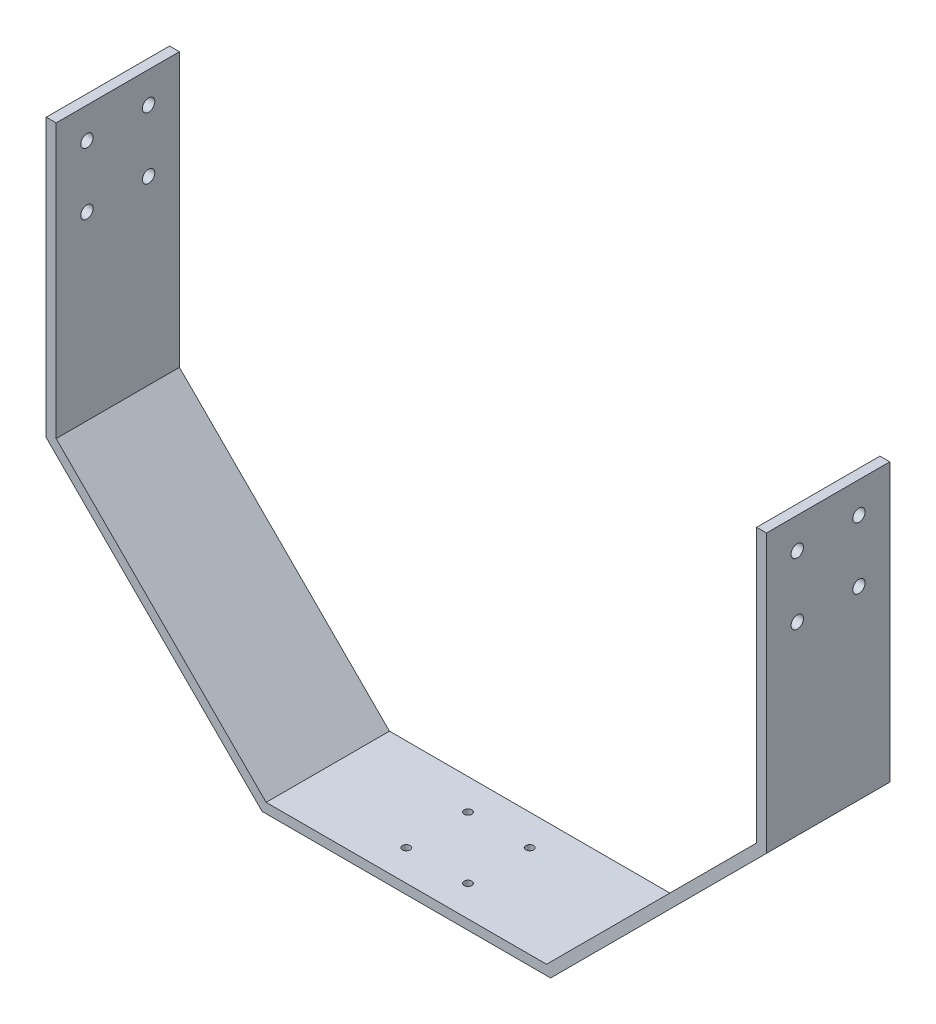
ISO-10303-21;
HEADER;
FILE_DESCRIPTION(('STEP AP214'),'2;1');
FILE_NAME('part.step','',(''),(''),'','','');
FILE_SCHEMA(('AUTOMOTIVE_DESIGN { 1 0 10303 214 1 1 1 1 }'));
ENDSEC;
DATA;
#1=APPLICATION_CONTEXT('core data for automotive mechanical design processes');
#2=APPLICATION_PROTOCOL_DEFINITION('international standard','automotive_design',2000,#1);
#3=PRODUCT_CONTEXT('',#1,'mechanical');
#4=PRODUCT('Part','Part','',(#3));
#5=PRODUCT_RELATED_PRODUCT_CATEGORY('part','',(#4));
#6=PRODUCT_DEFINITION_FORMATION('','',#4);
#7=PRODUCT_DEFINITION_CONTEXT('part definition',#1,'design');
#8=PRODUCT_DEFINITION('design','',#6,#7);
#9=PRODUCT_DEFINITION_SHAPE('','',#8);
#10=(LENGTH_UNIT() NAMED_UNIT(*) SI_UNIT(.MILLI.,.METRE.));
#11=(NAMED_UNIT(*) PLANE_ANGLE_UNIT() SI_UNIT($,.RADIAN.));
#12=(NAMED_UNIT(*) SI_UNIT($,.STERADIAN.) SOLID_ANGLE_UNIT());
#13=UNCERTAINTY_MEASURE_WITH_UNIT(LENGTH_MEASURE(1.E-05),#10,'distance_accuracy_value','');
#14=(GEOMETRIC_REPRESENTATION_CONTEXT(3) GLOBAL_UNCERTAINTY_ASSIGNED_CONTEXT((#13)) GLOBAL_UNIT_ASSIGNED_CONTEXT((#10,
#11,#12)) REPRESENTATION_CONTEXT('',''));
#15=CARTESIAN_POINT('',(0.,0.,0.));
#16=DIRECTION('',(0.,0.,1.));
#17=DIRECTION('',(1.,0.,0.));
#18=AXIS2_PLACEMENT_3D('',#15,#16,#17);
#19=CARTESIAN_POINT('',(292.608,203.2,50.8));
#20=DIRECTION('',(0.,-1.,0.));
#21=DIRECTION('',(0.,0.,-1.));
#22=AXIS2_PLACEMENT_3D('',#19,#20,#21);
#23=PLANE('',#22);
#24=DIRECTION('',(-1.,0.,0.));
#25=VECTOR('',#24,1.);
#26=CARTESIAN_POINT('',(292.608,203.2,0.));
#27=LINE('',#26,#25);
#28=CARTESIAN_POINT('',(296.672,203.2,0.));
#29=VERTEX_POINT('',#28);
#30=CARTESIAN_POINT('',(292.608,203.2,0.));
#31=VERTEX_POINT('',#30);
#32=EDGE_CURVE('E152',#29,#31,#27,.T.);
#33=ORIENTED_EDGE('',*,*,#32,.T.);
#34=DIRECTION('',(0.,0.,-1.));
#35=VECTOR('',#34,1.);
#36=CARTESIAN_POINT('',(292.608,203.2,50.8));
#37=LINE('',#36,#35);
#38=CARTESIAN_POINT('',(292.608,203.2,50.8));
#39=VERTEX_POINT('',#38);
#40=EDGE_CURVE('E11',#39,#31,#37,.T.);
#41=ORIENTED_EDGE('',*,*,#40,.F.);
#42=DIRECTION('',(-1.,0.,0.));
#43=VECTOR('',#42,1.);
#44=CARTESIAN_POINT('',(292.608,203.2,50.8));
#45=LINE('',#44,#43);
#46=CARTESIAN_POINT('',(296.672,203.2,50.8));
#47=VERTEX_POINT('',#46);
#48=EDGE_CURVE('E175',#47,#39,#45,.T.);
#49=ORIENTED_EDGE('',*,*,#48,.F.);
#50=DIRECTION('',(0.,0.,-1.));
#51=VECTOR('',#50,1.);
#52=CARTESIAN_POINT('',(296.672,203.2,50.8));
#53=LINE('',#52,#51);
#54=EDGE_CURVE('E148',#47,#29,#53,.T.);
#55=ORIENTED_EDGE('',*,*,#54,.T.);
#56=EDGE_LOOP('',(#33,#41,#49,#55));
#57=FACE_BOUND('',#56,.T.);
#58=ADVANCED_FACE('F32',(#57),#23,.F.);
#59=CARTESIAN_POINT('',(292.608,203.2,50.8));
#60=DIRECTION('',(1.,0.,0.));
#61=DIRECTION('',(0.,0.,-1.));
#62=AXIS2_PLACEMENT_3D('',#59,#60,#61);
#63=PLANE('',#62);
#64=CARTESIAN_POINT('',(292.608,190.5,38.1));
#65=DIRECTION('',(-1.,0.,0.));
#66=DIRECTION('',(0.,0.,1.));
#67=AXIS2_PLACEMENT_3D('',#64,#65,#66);
#68=CIRCLE('',#67,2.55269999999999);
#69=CARTESIAN_POINT('',(292.608,190.5,40.6527));
#70=VERTEX_POINT('',#69);
#71=EDGE_CURVE('E306',#70,#70,#68,.T.);
#72=ORIENTED_EDGE('',*,*,#71,.F.);
#73=EDGE_LOOP('',(#72));
#74=FACE_BOUND('',#73,.T.);
#75=CARTESIAN_POINT('',(292.608,165.1,12.7));
#76=DIRECTION('',(-1.,0.,0.));
#77=DIRECTION('',(0.,0.,1.));
#78=AXIS2_PLACEMENT_3D('',#75,#76,#77);
#79=CIRCLE('',#78,2.55269999999999);
#80=CARTESIAN_POINT('',(292.608,165.1,15.2527));
#81=VERTEX_POINT('',#80);
#82=EDGE_CURVE('E317',#81,#81,#79,.T.);
#83=ORIENTED_EDGE('',*,*,#82,.F.);
#84=EDGE_LOOP('',(#83));
#85=FACE_BOUND('',#84,.T.);
#86=CARTESIAN_POINT('',(292.608,165.1,38.1));
#87=DIRECTION('',(-1.,0.,0.));
#88=DIRECTION('',(0.,0.,1.));
#89=AXIS2_PLACEMENT_3D('',#86,#87,#88);
#90=CIRCLE('',#89,2.55269999999999);
#91=CARTESIAN_POINT('',(292.608,165.1,40.6527));
#92=VERTEX_POINT('',#91);
#93=EDGE_CURVE('E323',#92,#92,#90,.T.);
#94=ORIENTED_EDGE('',*,*,#93,.F.);
#95=EDGE_LOOP('',(#94));
#96=FACE_BOUND('',#95,.T.);
#97=CARTESIAN_POINT('',(292.608,190.5,12.7));
#98=DIRECTION('',(-1.,0.,0.));
#99=DIRECTION('',(0.,0.,1.));
#100=AXIS2_PLACEMENT_3D('',#97,#98,#99);
#101=CIRCLE('',#100,2.55269999999999);
#102=CARTESIAN_POINT('',(292.608,190.5,15.2527));
#103=VERTEX_POINT('',#102);
#104=EDGE_CURVE('E329',#103,#103,#101,.T.);
#105=ORIENTED_EDGE('',*,*,#104,.F.);
#106=EDGE_LOOP('',(#105));
#107=FACE_BOUND('',#106,.T.);
#108=DIRECTION('',(0.,-1.,0.));
#109=VECTOR('',#108,1.);
#110=CARTESIAN_POINT('',(292.608,203.2,0.));
#111=LINE('',#110,#109);
#112=CARTESIAN_POINT('',(292.608,90.5833639174842,0.));
#113=VERTEX_POINT('',#112);
#114=EDGE_CURVE('E155',#31,#113,#111,.T.);
#115=ORIENTED_EDGE('',*,*,#114,.T.);
#116=DIRECTION('',(0.,0.,-1.));
#117=VECTOR('',#116,1.);
#118=CARTESIAN_POINT('',(292.608,90.5833639174842,50.8));
#119=LINE('',#118,#117);
#120=CARTESIAN_POINT('',(292.608,90.5833639174842,50.8));
#121=VERTEX_POINT('',#120);
#122=EDGE_CURVE('E40',#121,#113,#119,.T.);
#123=ORIENTED_EDGE('',*,*,#122,.F.);
#124=DIRECTION('',(0.,-1.,0.));
#125=VECTOR('',#124,1.);
#126=CARTESIAN_POINT('',(292.608,203.2,50.8));
#127=LINE('',#126,#125);
#128=EDGE_CURVE('E103',#39,#121,#127,.T.);
#129=ORIENTED_EDGE('',*,*,#128,.F.);
#130=ORIENTED_EDGE('',*,*,#40,.T.);
#131=EDGE_LOOP('',(#115,#123,#129,#130));
#132=FACE_BOUND('',#131,.T.);
#133=ADVANCED_FACE('F256',(#74,#85,#96,#107,#132),#63,.F.);
#134=CARTESIAN_POINT('',(292.608,90.5833639174842,50.8));
#135=DIRECTION('',(0.707106781186547,-0.707106781186548,0.));
#136=DIRECTION('',(0.707106781186548,0.707106781186547,0.));
#137=AXIS2_PLACEMENT_3D('',#134,#135,#136);
#138=PLANE('',#137);
#139=DIRECTION('',(-0.707106781186548,-0.707106781186547,0.));
#140=VECTOR('',#139,1.);
#141=CARTESIAN_POINT('',(292.608,90.5833639174842,0.));
#142=LINE('',#141,#140);
#143=CARTESIAN_POINT('',(206.088636082516,4.064,0.));
#144=VERTEX_POINT('',#143);
#145=EDGE_CURVE('E158',#113,#144,#142,.T.);
#146=ORIENTED_EDGE('',*,*,#145,.T.);
#147=DIRECTION('',(0.,0.,-1.));
#148=VECTOR('',#147,1.);
#149=CARTESIAN_POINT('',(206.088636082516,4.064,50.8));
#150=LINE('',#149,#148);
#151=CARTESIAN_POINT('',(206.088636082516,4.064,50.8));
#152=VERTEX_POINT('',#151);
#153=EDGE_CURVE('E194',#152,#144,#150,.T.);
#154=ORIENTED_EDGE('',*,*,#153,.F.);
#155=DIRECTION('',(-0.707106781186548,-0.707106781186547,0.));
#156=VECTOR('',#155,1.);
#157=CARTESIAN_POINT('',(292.608,90.5833639174842,50.8));
#158=LINE('',#157,#156);
#159=EDGE_CURVE('E202',#121,#152,#158,.T.);
#160=ORIENTED_EDGE('',*,*,#159,.F.);
#161=ORIENTED_EDGE('',*,*,#122,.T.);
#162=EDGE_LOOP('',(#146,#154,#160,#161));
#163=FACE_BOUND('',#162,.T.);
#164=ADVANCED_FACE('F200',(#163),#138,.F.);
#165=CARTESIAN_POINT('',(90.5833639174845,4.064,50.8));
#166=DIRECTION('',(0.,-1.,0.));
#167=DIRECTION('',(1.,0.,0.));
#168=AXIS2_PLACEMENT_3D('',#165,#166,#167);
#169=PLANE('',#168);
#170=CARTESIAN_POINT('',(135.636,4.064,38.1));
#171=DIRECTION('',(0.,1.,0.));
#172=DIRECTION('',(0.,0.,1.));
#173=AXIS2_PLACEMENT_3D('',#170,#171,#172);
#174=CIRCLE('',#173,1.58749999999999);
#175=CARTESIAN_POINT('',(135.636,4.064,39.6875));
#176=VERTEX_POINT('',#175);
#177=EDGE_CURVE('E422',#176,#176,#174,.T.);
#178=ORIENTED_EDGE('',*,*,#177,.F.);
#179=EDGE_LOOP('',(#178));
#180=FACE_BOUND('',#179,.T.);
#181=CARTESIAN_POINT('',(161.036,4.064,12.7));
#182=DIRECTION('',(0.,1.,0.));
#183=DIRECTION('',(0.,0.,1.));
#184=AXIS2_PLACEMENT_3D('',#181,#182,#183);
#185=CIRCLE('',#184,1.58749999999999);
#186=CARTESIAN_POINT('',(161.036,4.064,14.2875));
#187=VERTEX_POINT('',#186);
#188=EDGE_CURVE('E424',#187,#187,#185,.T.);
#189=ORIENTED_EDGE('',*,*,#188,.F.);
#190=EDGE_LOOP('',(#189));
#191=FACE_BOUND('',#190,.T.);
#192=CARTESIAN_POINT('',(135.636,4.064,12.7));
#193=DIRECTION('',(0.,1.,0.));
#194=DIRECTION('',(0.,0.,1.));
#195=AXIS2_PLACEMENT_3D('',#192,#193,#194);
#196=CIRCLE('',#195,1.58749999999999);
#197=CARTESIAN_POINT('',(135.636,4.064,14.2875));
#198=VERTEX_POINT('',#197);
#199=EDGE_CURVE('E430',#198,#198,#196,.T.);
#200=ORIENTED_EDGE('',*,*,#199,.F.);
#201=EDGE_LOOP('',(#200));
#202=FACE_BOUND('',#201,.T.);
#203=CARTESIAN_POINT('',(161.036,4.064,38.1));
#204=DIRECTION('',(0.,1.,0.));
#205=DIRECTION('',(0.,0.,1.));
#206=AXIS2_PLACEMENT_3D('',#203,#204,#205);
#207=CIRCLE('',#206,1.58749999999999);
#208=CARTESIAN_POINT('',(161.036,4.064,39.6875));
#209=VERTEX_POINT('',#208);
#210=EDGE_CURVE('E307',#209,#209,#207,.T.);
#211=ORIENTED_EDGE('',*,*,#210,.F.);
#212=EDGE_LOOP('',(#211));
#213=FACE_BOUND('',#212,.T.);
#214=DIRECTION('',(-1.,0.,0.));
#215=VECTOR('',#214,1.);
#216=CARTESIAN_POINT('',(90.5833639174845,4.064,0.));
#217=LINE('',#216,#215);
#218=CARTESIAN_POINT('',(90.5833639174845,4.064,0.));
#219=VERTEX_POINT('',#218);
#220=EDGE_CURVE('E160',#144,#219,#217,.T.);
#221=ORIENTED_EDGE('',*,*,#220,.T.);
#222=DIRECTION('',(0.,0.,-1.));
#223=VECTOR('',#222,1.);
#224=CARTESIAN_POINT('',(90.5833639174845,4.064,50.8));
#225=LINE('',#224,#223);
#226=CARTESIAN_POINT('',(90.5833639174845,4.064,50.8));
#227=VERTEX_POINT('',#226);
#228=EDGE_CURVE('E191',#227,#219,#225,.T.);
#229=ORIENTED_EDGE('',*,*,#228,.F.);
#230=DIRECTION('',(-1.,0.,0.));
#231=VECTOR('',#230,1.);
#232=CARTESIAN_POINT('',(90.5833639174845,4.064,50.8));
#233=LINE('',#232,#231);
#234=EDGE_CURVE('E220',#152,#227,#233,.T.);
#235=ORIENTED_EDGE('',*,*,#234,.F.);
#236=ORIENTED_EDGE('',*,*,#153,.T.);
#237=EDGE_LOOP('',(#221,#229,#235,#236));
#238=FACE_BOUND('',#237,.T.);
#239=ADVANCED_FACE('F211',(#180,#191,#202,#213,#238),#169,.F.);
#240=CARTESIAN_POINT('',(4.06400000000001,90.5833639174842,50.8));
#241=DIRECTION('',(-0.707106781186547,-0.707106781186548,0.));
#242=DIRECTION('',(0.707106781186548,-0.707106781186547,0.));
#243=AXIS2_PLACEMENT_3D('',#240,#241,#242);
#244=PLANE('',#243);
#245=DIRECTION('',(-0.707106781186548,0.707106781186547,0.));
#246=VECTOR('',#245,1.);
#247=CARTESIAN_POINT('',(4.06400000000001,90.5833639174842,0.));
#248=LINE('',#247,#246);
#249=CARTESIAN_POINT('',(4.06400000000001,90.5833639174842,0.));
#250=VERTEX_POINT('',#249);
#251=EDGE_CURVE('E162',#219,#250,#248,.T.);
#252=ORIENTED_EDGE('',*,*,#251,.T.);
#253=DIRECTION('',(0.,0.,-1.));
#254=VECTOR('',#253,1.);
#255=CARTESIAN_POINT('',(4.06400000000001,90.5833639174842,50.8));
#256=LINE('',#255,#254);
#257=CARTESIAN_POINT('',(4.06400000000001,90.5833639174842,50.8));
#258=VERTEX_POINT('',#257);
#259=EDGE_CURVE('E188',#258,#250,#256,.T.);
#260=ORIENTED_EDGE('',*,*,#259,.F.);
#261=DIRECTION('',(-0.707106781186548,0.707106781186547,0.));
#262=VECTOR('',#261,1.);
#263=CARTESIAN_POINT('',(4.06400000000001,90.5833639174842,50.8));
#264=LINE('',#263,#262);
#265=EDGE_CURVE('E217',#227,#258,#264,.T.);
#266=ORIENTED_EDGE('',*,*,#265,.F.);
#267=ORIENTED_EDGE('',*,*,#228,.T.);
#268=EDGE_LOOP('',(#252,#260,#266,#267));
#269=FACE_BOUND('',#268,.T.);
#270=ADVANCED_FACE('F215',(#269),#244,.F.);
#271=CARTESIAN_POINT('',(4.064,203.2,50.8));
#272=DIRECTION('',(-1.,0.,0.));
#273=DIRECTION('',(0.,-1.,0.));
#274=AXIS2_PLACEMENT_3D('',#271,#272,#273);
#275=PLANE('',#274);
#276=CARTESIAN_POINT('',(4.06400000000003,190.5,38.1));
#277=DIRECTION('',(1.,0.,0.));
#278=DIRECTION('',(0.,0.,-1.));
#279=AXIS2_PLACEMENT_3D('',#276,#277,#278);
#280=CIRCLE('',#279,2.55269999999999);
#281=CARTESIAN_POINT('',(4.06400000000003,190.5,35.5473));
#282=VERTEX_POINT('',#281);
#283=EDGE_CURVE('E335',#282,#282,#280,.T.);
#284=ORIENTED_EDGE('',*,*,#283,.F.);
#285=EDGE_LOOP('',(#284));
#286=FACE_BOUND('',#285,.T.);
#287=CARTESIAN_POINT('',(4.06400000000003,165.1,12.7));
#288=DIRECTION('',(1.,0.,0.));
#289=DIRECTION('',(0.,0.,-1.));
#290=AXIS2_PLACEMENT_3D('',#287,#288,#289);
#291=CIRCLE('',#290,2.55269999999999);
#292=CARTESIAN_POINT('',(4.06400000000003,165.1,10.1473));
#293=VERTEX_POINT('',#292);
#294=EDGE_CURVE('E341',#293,#293,#291,.T.);
#295=ORIENTED_EDGE('',*,*,#294,.F.);
#296=EDGE_LOOP('',(#295));
#297=FACE_BOUND('',#296,.T.);
#298=CARTESIAN_POINT('',(4.06400000000003,165.1,38.1));
#299=DIRECTION('',(1.,0.,0.));
#300=DIRECTION('',(0.,0.,-1.));
#301=AXIS2_PLACEMENT_3D('',#298,#299,#300);
#302=CIRCLE('',#301,2.55269999999999);
#303=CARTESIAN_POINT('',(4.06400000000003,165.1,35.5473));
#304=VERTEX_POINT('',#303);
#305=EDGE_CURVE('E347',#304,#304,#302,.T.);
#306=ORIENTED_EDGE('',*,*,#305,.F.);
#307=EDGE_LOOP('',(#306));
#308=FACE_BOUND('',#307,.T.);
#309=CARTESIAN_POINT('',(4.06400000000003,190.5,12.7));
#310=DIRECTION('',(1.,0.,0.));
#311=DIRECTION('',(0.,0.,-1.));
#312=AXIS2_PLACEMENT_3D('',#309,#310,#311);
#313=CIRCLE('',#312,2.55269999999999);
#314=CARTESIAN_POINT('',(4.06400000000003,190.5,10.1473));
#315=VERTEX_POINT('',#314);
#316=EDGE_CURVE('E353',#315,#315,#313,.T.);
#317=ORIENTED_EDGE('',*,*,#316,.F.);
#318=EDGE_LOOP('',(#317));
#319=FACE_BOUND('',#318,.T.);
#320=DIRECTION('',(0.,1.,0.));
#321=VECTOR('',#320,1.);
#322=CARTESIAN_POINT('',(4.064,203.2,0.));
#323=LINE('',#322,#321);
#324=CARTESIAN_POINT('',(4.064,203.2,0.));
#325=VERTEX_POINT('',#324);
#326=EDGE_CURVE('E164',#250,#325,#323,.T.);
#327=ORIENTED_EDGE('',*,*,#326,.T.);
#328=DIRECTION('',(0.,0.,-1.));
#329=VECTOR('',#328,1.);
#330=CARTESIAN_POINT('',(4.064,203.2,50.8));
#331=LINE('',#330,#329);
#332=CARTESIAN_POINT('',(4.064,203.2,50.8));
#333=VERTEX_POINT('',#332);
#334=EDGE_CURVE('E185',#333,#325,#331,.T.);
#335=ORIENTED_EDGE('',*,*,#334,.F.);
#336=DIRECTION('',(0.,1.,0.));
#337=VECTOR('',#336,1.);
#338=CARTESIAN_POINT('',(4.064,203.2,50.8));
#339=LINE('',#338,#337);
#340=EDGE_CURVE('E219',#258,#333,#339,.T.);
#341=ORIENTED_EDGE('',*,*,#340,.F.);
#342=ORIENTED_EDGE('',*,*,#259,.T.);
#343=EDGE_LOOP('',(#327,#335,#341,#342));
#344=FACE_BOUND('',#343,.T.);
#345=ADVANCED_FACE('F273',(#286,#297,#308,#319,#344),#275,.F.);
#346=CARTESIAN_POINT('',(4.064,203.2,50.8));
#347=DIRECTION('',(0.,-1.,0.));
#348=DIRECTION('',(0.,0.,-1.));
#349=AXIS2_PLACEMENT_3D('',#346,#347,#348);
#350=PLANE('',#349);
#351=DIRECTION('',(-1.,0.,0.));
#352=VECTOR('',#351,1.);
#353=CARTESIAN_POINT('',(4.064,203.2,0.));
#354=LINE('',#353,#352);
#355=CARTESIAN_POINT('',(0.,203.2,0.));
#356=VERTEX_POINT('',#355);
#357=EDGE_CURVE('E166',#325,#356,#354,.T.);
#358=ORIENTED_EDGE('',*,*,#357,.T.);
#359=DIRECTION('',(0.,0.,-1.));
#360=VECTOR('',#359,1.);
#361=CARTESIAN_POINT('',(0.,203.2,50.8));
#362=LINE('',#361,#360);
#363=CARTESIAN_POINT('',(0.,203.2,50.8));
#364=VERTEX_POINT('',#363);
#365=EDGE_CURVE('E182',#364,#356,#362,.T.);
#366=ORIENTED_EDGE('',*,*,#365,.F.);
#367=DIRECTION('',(-1.,0.,0.));
#368=VECTOR('',#367,1.);
#369=CARTESIAN_POINT('',(4.064,203.2,50.8));
#370=LINE('',#369,#368);
#371=EDGE_CURVE('E222',#333,#364,#370,.T.);
#372=ORIENTED_EDGE('',*,*,#371,.F.);
#373=ORIENTED_EDGE('',*,*,#334,.T.);
#374=EDGE_LOOP('',(#358,#366,#372,#373));
#375=FACE_BOUND('',#374,.T.);
#376=ADVANCED_FACE('F276',(#375),#350,.F.);
#377=CARTESIAN_POINT('',(0.,203.2,50.8));
#378=DIRECTION('',(1.,0.,0.));
#379=DIRECTION('',(0.,1.,0.));
#380=AXIS2_PLACEMENT_3D('',#377,#378,#379);
#381=PLANE('',#380);
#382=CARTESIAN_POINT('',(0.,190.5,38.1));
#383=DIRECTION('',(1.,0.,0.));
#384=DIRECTION('',(0.,0.,-1.));
#385=AXIS2_PLACEMENT_3D('',#382,#383,#384);
#386=CIRCLE('',#385,2.55269999999999);
#387=CARTESIAN_POINT('',(0.,190.5,35.5473));
#388=VERTEX_POINT('',#387);
#389=EDGE_CURVE('E338',#388,#388,#386,.T.);
#390=ORIENTED_EDGE('',*,*,#389,.T.);
#391=EDGE_LOOP('',(#390));
#392=FACE_BOUND('',#391,.T.);
#393=CARTESIAN_POINT('',(0.,165.1,12.7));
#394=DIRECTION('',(1.,0.,0.));
#395=DIRECTION('',(0.,0.,-1.));
#396=AXIS2_PLACEMENT_3D('',#393,#394,#395);
#397=CIRCLE('',#396,2.55269999999999);
#398=CARTESIAN_POINT('',(0.,165.1,10.1473));
#399=VERTEX_POINT('',#398);
#400=EDGE_CURVE('E344',#399,#399,#397,.T.);
#401=ORIENTED_EDGE('',*,*,#400,.T.);
#402=EDGE_LOOP('',(#401));
#403=FACE_BOUND('',#402,.T.);
#404=CARTESIAN_POINT('',(0.,165.1,38.1));
#405=DIRECTION('',(1.,0.,0.));
#406=DIRECTION('',(0.,0.,-1.));
#407=AXIS2_PLACEMENT_3D('',#404,#405,#406);
#408=CIRCLE('',#407,2.55269999999999);
#409=CARTESIAN_POINT('',(0.,165.1,35.5473));
#410=VERTEX_POINT('',#409);
#411=EDGE_CURVE('E350',#410,#410,#408,.T.);
#412=ORIENTED_EDGE('',*,*,#411,.T.);
#413=EDGE_LOOP('',(#412));
#414=FACE_BOUND('',#413,.T.);
#415=CARTESIAN_POINT('',(0.,190.5,12.7));
#416=DIRECTION('',(1.,0.,0.));
#417=DIRECTION('',(0.,0.,-1.));
#418=AXIS2_PLACEMENT_3D('',#415,#416,#417);
#419=CIRCLE('',#418,2.55269999999999);
#420=CARTESIAN_POINT('',(0.,190.5,10.1473));
#421=VERTEX_POINT('',#420);
#422=EDGE_CURVE('E156',#421,#421,#419,.T.);
#423=ORIENTED_EDGE('',*,*,#422,.T.);
#424=EDGE_LOOP('',(#423));
#425=FACE_BOUND('',#424,.T.);
#426=DIRECTION('',(0.,-1.,0.));
#427=VECTOR('',#426,1.);
#428=CARTESIAN_POINT('',(0.,203.2,0.));
#429=LINE('',#428,#427);
#430=CARTESIAN_POINT('',(0.,88.9,0.));
#431=VERTEX_POINT('',#430);
#432=EDGE_CURVE('E168',#356,#431,#429,.T.);
#433=ORIENTED_EDGE('',*,*,#432,.T.);
#434=DIRECTION('',(0.,0.,-1.));
#435=VECTOR('',#434,1.);
#436=CARTESIAN_POINT('',(0.,88.9,50.8));
#437=LINE('',#436,#435);
#438=CARTESIAN_POINT('',(0.,88.9,50.8));
#439=VERTEX_POINT('',#438);
#440=EDGE_CURVE('E179',#439,#431,#437,.T.);
#441=ORIENTED_EDGE('',*,*,#440,.F.);
#442=DIRECTION('',(0.,-1.,0.));
#443=VECTOR('',#442,1.);
#444=CARTESIAN_POINT('',(0.,203.2,50.8));
#445=LINE('',#444,#443);
#446=EDGE_CURVE('E228',#364,#439,#445,.T.);
#447=ORIENTED_EDGE('',*,*,#446,.F.);
#448=ORIENTED_EDGE('',*,*,#365,.T.);
#449=EDGE_LOOP('',(#433,#441,#447,#448));
#450=FACE_BOUND('',#449,.T.);
#451=ADVANCED_FACE('F234',(#392,#403,#414,#425,#450),#381,.F.);
#452=CARTESIAN_POINT('',(0.,88.9,50.8));
#453=DIRECTION('',(0.707106781186547,0.707106781186548,0.));
#454=DIRECTION('',(-0.707106781186548,0.707106781186547,0.));
#455=AXIS2_PLACEMENT_3D('',#452,#453,#454);
#456=PLANE('',#455);
#457=DIRECTION('',(0.707106781186548,-0.707106781186547,0.));
#458=VECTOR('',#457,1.);
#459=CARTESIAN_POINT('',(0.,88.9,0.));
#460=LINE('',#459,#458);
#461=CARTESIAN_POINT('',(88.9000000000002,0.,0.));
#462=VERTEX_POINT('',#461);
#463=EDGE_CURVE('E170',#431,#462,#460,.T.);
#464=ORIENTED_EDGE('',*,*,#463,.T.);
#465=DIRECTION('',(0.,0.,-1.));
#466=VECTOR('',#465,1.);
#467=CARTESIAN_POINT('',(88.9000000000002,0.,50.8));
#468=LINE('',#467,#466);
#469=CARTESIAN_POINT('',(88.9000000000002,0.,50.8));
#470=VERTEX_POINT('',#469);
#471=EDGE_CURVE('E143',#470,#462,#468,.T.);
#472=ORIENTED_EDGE('',*,*,#471,.F.);
#473=DIRECTION('',(0.707106781186548,-0.707106781186547,0.));
#474=VECTOR('',#473,1.);
#475=CARTESIAN_POINT('',(0.,88.9,50.8));
#476=LINE('',#475,#474);
#477=EDGE_CURVE('E134',#439,#470,#476,.T.);
#478=ORIENTED_EDGE('',*,*,#477,.F.);
#479=ORIENTED_EDGE('',*,*,#440,.T.);
#480=EDGE_LOOP('',(#464,#472,#478,#479));
#481=FACE_BOUND('',#480,.T.);
#482=ADVANCED_FACE('F238',(#481),#456,.F.);
#483=CARTESIAN_POINT('',(88.9000000000002,0.,50.8));
#484=DIRECTION('',(0.,1.,0.));
#485=DIRECTION('',(-1.,0.,0.));
#486=AXIS2_PLACEMENT_3D('',#483,#484,#485);
#487=PLANE('',#486);
#488=CARTESIAN_POINT('',(135.636,0.,38.1));
#489=DIRECTION('',(0.,1.,0.));
#490=DIRECTION('',(0.,0.,1.));
#491=AXIS2_PLACEMENT_3D('',#488,#489,#490);
#492=CIRCLE('',#491,1.58749999999999);
#493=CARTESIAN_POINT('',(135.636,0.,39.6875));
#494=VERTEX_POINT('',#493);
#495=EDGE_CURVE('E293',#494,#494,#492,.T.);
#496=ORIENTED_EDGE('',*,*,#495,.T.);
#497=EDGE_LOOP('',(#496));
#498=FACE_BOUND('',#497,.T.);
#499=CARTESIAN_POINT('',(161.036,0.,12.7));
#500=DIRECTION('',(0.,1.,0.));
#501=DIRECTION('',(0.,0.,1.));
#502=AXIS2_PLACEMENT_3D('',#499,#500,#501);
#503=CIRCLE('',#502,1.58749999999999);
#504=CARTESIAN_POINT('',(161.036,0.,14.2875));
#505=VERTEX_POINT('',#504);
#506=EDGE_CURVE('E297',#505,#505,#503,.T.);
#507=ORIENTED_EDGE('',*,*,#506,.T.);
#508=EDGE_LOOP('',(#507));
#509=FACE_BOUND('',#508,.T.);
#510=CARTESIAN_POINT('',(135.636,0.,12.7));
#511=DIRECTION('',(0.,1.,0.));
#512=DIRECTION('',(0.,0.,1.));
#513=AXIS2_PLACEMENT_3D('',#510,#511,#512);
#514=CIRCLE('',#513,1.58749999999999);
#515=CARTESIAN_POINT('',(135.636,0.,14.2875));
#516=VERTEX_POINT('',#515);
#517=EDGE_CURVE('E301',#516,#516,#514,.T.);
#518=ORIENTED_EDGE('',*,*,#517,.T.);
#519=EDGE_LOOP('',(#518));
#520=FACE_BOUND('',#519,.T.);
#521=CARTESIAN_POINT('',(161.036,0.,38.1));
#522=DIRECTION('',(0.,1.,0.));
#523=DIRECTION('',(0.,0.,1.));
#524=AXIS2_PLACEMENT_3D('',#521,#522,#523);
#525=CIRCLE('',#524,1.58749999999999);
#526=CARTESIAN_POINT('',(161.036,0.,39.6875));
#527=VERTEX_POINT('',#526);
#528=EDGE_CURVE('E304',#527,#527,#525,.T.);
#529=ORIENTED_EDGE('',*,*,#528,.T.);
#530=EDGE_LOOP('',(#529));
#531=FACE_BOUND('',#530,.T.);
#532=DIRECTION('',(1.,0.,0.));
#533=VECTOR('',#532,1.);
#534=CARTESIAN_POINT('',(88.9000000000002,0.,0.));
#535=LINE('',#534,#533);
#536=CARTESIAN_POINT('',(207.772,0.,0.));
#537=VERTEX_POINT('',#536);
#538=EDGE_CURVE('E142',#462,#537,#535,.T.);
#539=ORIENTED_EDGE('',*,*,#538,.T.);
#540=DIRECTION('',(0.,0.,-1.));
#541=VECTOR('',#540,1.);
#542=CARTESIAN_POINT('',(207.772,0.,50.8));
#543=LINE('',#542,#541);
#544=CARTESIAN_POINT('',(207.772,0.,50.8));
#545=VERTEX_POINT('',#544);
#546=EDGE_CURVE('E139',#545,#537,#543,.T.);
#547=ORIENTED_EDGE('',*,*,#546,.F.);
#548=DIRECTION('',(1.,0.,0.));
#549=VECTOR('',#548,1.);
#550=CARTESIAN_POINT('',(88.9000000000002,0.,50.8));
#551=LINE('',#550,#549);
#552=EDGE_CURVE('E128',#470,#545,#551,.T.);
#553=ORIENTED_EDGE('',*,*,#552,.F.);
#554=ORIENTED_EDGE('',*,*,#471,.T.);
#555=EDGE_LOOP('',(#539,#547,#553,#554));
#556=FACE_BOUND('',#555,.T.);
#557=ADVANCED_FACE('F140',(#498,#509,#520,#531,#556),#487,.F.);
#558=CARTESIAN_POINT('',(296.672,88.9,50.8));
#559=DIRECTION('',(-0.707106781186547,0.707106781186548,0.));
#560=DIRECTION('',(-0.707106781186548,-0.707106781186547,0.));
#561=AXIS2_PLACEMENT_3D('',#558,#559,#560);
#562=PLANE('',#561);
#563=DIRECTION('',(0.707106781186548,0.707106781186547,0.));
#564=VECTOR('',#563,1.);
#565=CARTESIAN_POINT('',(296.672,88.9,0.));
#566=LINE('',#565,#564);
#567=CARTESIAN_POINT('',(296.672,88.9,0.));
#568=VERTEX_POINT('',#567);
#569=EDGE_CURVE('E89',#537,#568,#566,.T.);
#570=ORIENTED_EDGE('',*,*,#569,.T.);
#571=DIRECTION('',(0.,0.,-1.));
#572=VECTOR('',#571,1.);
#573=CARTESIAN_POINT('',(296.672,88.9,50.8));
#574=LINE('',#573,#572);
#575=CARTESIAN_POINT('',(296.672,88.9,50.8));
#576=VERTEX_POINT('',#575);
#577=EDGE_CURVE('E144',#576,#568,#574,.T.);
#578=ORIENTED_EDGE('',*,*,#577,.F.);
#579=DIRECTION('',(0.707106781186548,0.707106781186547,0.));
#580=VECTOR('',#579,1.);
#581=CARTESIAN_POINT('',(296.672,88.9,50.8));
#582=LINE('',#581,#580);
#583=EDGE_CURVE('E132',#545,#576,#582,.T.);
#584=ORIENTED_EDGE('',*,*,#583,.F.);
#585=ORIENTED_EDGE('',*,*,#546,.T.);
#586=EDGE_LOOP('',(#570,#578,#584,#585));
#587=FACE_BOUND('',#586,.T.);
#588=ADVANCED_FACE('F146',(#587),#562,.F.);
#589=CARTESIAN_POINT('',(296.672,203.2,50.8));
#590=DIRECTION('',(-1.,0.,0.));
#591=DIRECTION('',(0.,-1.,0.));
#592=AXIS2_PLACEMENT_3D('',#589,#590,#591);
#593=PLANE('',#592);
#594=CARTESIAN_POINT('',(296.672,190.5,38.1));
#595=DIRECTION('',(-1.,0.,0.));
#596=DIRECTION('',(0.,0.,1.));
#597=AXIS2_PLACEMENT_3D('',#594,#595,#596);
#598=CIRCLE('',#597,2.55269999999999);
#599=CARTESIAN_POINT('',(296.672,190.5,40.6527));
#600=VERTEX_POINT('',#599);
#601=EDGE_CURVE('E310',#600,#600,#598,.T.);
#602=ORIENTED_EDGE('',*,*,#601,.T.);
#603=EDGE_LOOP('',(#602));
#604=FACE_BOUND('',#603,.T.);
#605=CARTESIAN_POINT('',(296.672,165.1,12.7));
#606=DIRECTION('',(-1.,0.,0.));
#607=DIRECTION('',(0.,0.,1.));
#608=AXIS2_PLACEMENT_3D('',#605,#606,#607);
#609=CIRCLE('',#608,2.55269999999999);
#610=CARTESIAN_POINT('',(296.672,165.1,15.2527));
#611=VERTEX_POINT('',#610);
#612=EDGE_CURVE('E320',#611,#611,#609,.T.);
#613=ORIENTED_EDGE('',*,*,#612,.T.);
#614=EDGE_LOOP('',(#613));
#615=FACE_BOUND('',#614,.T.);
#616=CARTESIAN_POINT('',(296.672,165.1,38.1));
#617=DIRECTION('',(-1.,0.,0.));
#618=DIRECTION('',(0.,0.,1.));
#619=AXIS2_PLACEMENT_3D('',#616,#617,#618);
#620=CIRCLE('',#619,2.55269999999999);
#621=CARTESIAN_POINT('',(296.672,165.1,40.6527));
#622=VERTEX_POINT('',#621);
#623=EDGE_CURVE('E326',#622,#622,#620,.T.);
#624=ORIENTED_EDGE('',*,*,#623,.T.);
#625=EDGE_LOOP('',(#624));
#626=FACE_BOUND('',#625,.T.);
#627=CARTESIAN_POINT('',(296.672,190.5,12.7));
#628=DIRECTION('',(-1.,0.,0.));
#629=DIRECTION('',(0.,0.,1.));
#630=AXIS2_PLACEMENT_3D('',#627,#628,#629);
#631=CIRCLE('',#630,2.55269999999999);
#632=CARTESIAN_POINT('',(296.672,190.5,15.2527));
#633=VERTEX_POINT('',#632);
#634=EDGE_CURVE('E332',#633,#633,#631,.T.);
#635=ORIENTED_EDGE('',*,*,#634,.T.);
#636=EDGE_LOOP('',(#635));
#637=FACE_BOUND('',#636,.T.);
#638=DIRECTION('',(0.,1.,0.));
#639=VECTOR('',#638,1.);
#640=CARTESIAN_POINT('',(296.672,203.2,0.));
#641=LINE('',#640,#639);
#642=EDGE_CURVE('E95',#568,#29,#641,.T.);
#643=ORIENTED_EDGE('',*,*,#642,.T.);
#644=ORIENTED_EDGE('',*,*,#54,.F.);
#645=DIRECTION('',(0.,1.,0.));
#646=VECTOR('',#645,1.);
#647=CARTESIAN_POINT('',(296.672,203.2,50.8));
#648=LINE('',#647,#646);
#649=EDGE_CURVE('E48',#576,#47,#648,.T.);
#650=ORIENTED_EDGE('',*,*,#649,.F.);
#651=ORIENTED_EDGE('',*,*,#577,.T.);
#652=EDGE_LOOP('',(#643,#644,#650,#651));
#653=FACE_BOUND('',#652,.T.);
#654=ADVANCED_FACE('F242',(#604,#615,#626,#637,#653),#593,.F.);
#655=CARTESIAN_POINT('',(0.,0.,50.8));
#656=DIRECTION('',(0.,0.,-1.));
#657=DIRECTION('',(-1.,0.,0.));
#658=AXIS2_PLACEMENT_3D('',#655,#656,#657);
#659=PLANE('',#658);
#660=ORIENTED_EDGE('',*,*,#48,.T.);
#661=ORIENTED_EDGE('',*,*,#128,.T.);
#662=ORIENTED_EDGE('',*,*,#159,.T.);
#663=ORIENTED_EDGE('',*,*,#234,.T.);
#664=ORIENTED_EDGE('',*,*,#265,.T.);
#665=ORIENTED_EDGE('',*,*,#340,.T.);
#666=ORIENTED_EDGE('',*,*,#371,.T.);
#667=ORIENTED_EDGE('',*,*,#446,.T.);
#668=ORIENTED_EDGE('',*,*,#477,.T.);
#669=ORIENTED_EDGE('',*,*,#552,.T.);
#670=ORIENTED_EDGE('',*,*,#583,.T.);
#671=ORIENTED_EDGE('',*,*,#649,.T.);
#672=EDGE_LOOP('',(#660,#661,#662,#663,#664,#665,#666,#667,#668,#669,#670,#671));
#673=FACE_BOUND('',#672,.T.);
#674=ADVANCED_FACE('F130',(#673),#659,.F.);
#675=CARTESIAN_POINT('',(0.,0.,0.));
#676=DIRECTION('',(0.,0.,-1.));
#677=DIRECTION('',(-1.,0.,0.));
#678=AXIS2_PLACEMENT_3D('',#675,#676,#677);
#679=PLANE('',#678);
#680=ORIENTED_EDGE('',*,*,#32,.F.);
#681=ORIENTED_EDGE('',*,*,#642,.F.);
#682=ORIENTED_EDGE('',*,*,#569,.F.);
#683=ORIENTED_EDGE('',*,*,#538,.F.);
#684=ORIENTED_EDGE('',*,*,#463,.F.);
#685=ORIENTED_EDGE('',*,*,#432,.F.);
#686=ORIENTED_EDGE('',*,*,#357,.F.);
#687=ORIENTED_EDGE('',*,*,#326,.F.);
#688=ORIENTED_EDGE('',*,*,#251,.F.);
#689=ORIENTED_EDGE('',*,*,#220,.F.);
#690=ORIENTED_EDGE('',*,*,#145,.F.);
#691=ORIENTED_EDGE('',*,*,#114,.F.);
#692=EDGE_LOOP('',(#680,#681,#682,#683,#684,#685,#686,#687,#688,#689,#690,#691));
#693=FACE_BOUND('',#692,.T.);
#694=ADVANCED_FACE('F206',(#693),#679,.T.);
#695=CARTESIAN_POINT('',(4.06400000000003,190.5,12.7));
#696=DIRECTION('',(1.,0.,0.));
#697=DIRECTION('',(0.,0.,-1.));
#698=AXIS2_PLACEMENT_3D('',#695,#696,#697);
#699=CYLINDRICAL_SURFACE('',#698,2.55269999999999);
#700=ORIENTED_EDGE('',*,*,#422,.F.);
#701=EDGE_LOOP('',(#700));
#702=FACE_BOUND('',#701,.T.);
#703=ORIENTED_EDGE('',*,*,#316,.T.);
#704=EDGE_LOOP('',(#703));
#705=FACE_BOUND('',#704,.T.);
#706=ADVANCED_FACE('F362',(#702,#705),#699,.F.);
#707=CARTESIAN_POINT('',(4.06400000000003,165.1,38.1));
#708=DIRECTION('',(1.,0.,0.));
#709=DIRECTION('',(0.,0.,-1.));
#710=AXIS2_PLACEMENT_3D('',#707,#708,#709);
#711=CYLINDRICAL_SURFACE('',#710,2.55269999999999);
#712=ORIENTED_EDGE('',*,*,#411,.F.);
#713=EDGE_LOOP('',(#712));
#714=FACE_BOUND('',#713,.T.);
#715=ORIENTED_EDGE('',*,*,#305,.T.);
#716=EDGE_LOOP('',(#715));
#717=FACE_BOUND('',#716,.T.);
#718=ADVANCED_FACE('F365',(#714,#717),#711,.F.);
#719=CARTESIAN_POINT('',(4.06400000000003,165.1,12.7));
#720=DIRECTION('',(1.,0.,0.));
#721=DIRECTION('',(0.,0.,-1.));
#722=AXIS2_PLACEMENT_3D('',#719,#720,#721);
#723=CYLINDRICAL_SURFACE('',#722,2.55269999999999);
#724=ORIENTED_EDGE('',*,*,#400,.F.);
#725=EDGE_LOOP('',(#724));
#726=FACE_BOUND('',#725,.T.);
#727=ORIENTED_EDGE('',*,*,#294,.T.);
#728=EDGE_LOOP('',(#727));
#729=FACE_BOUND('',#728,.T.);
#730=ADVANCED_FACE('F376',(#726,#729),#723,.F.);
#731=CARTESIAN_POINT('',(4.06400000000003,190.5,38.1));
#732=DIRECTION('',(1.,0.,0.));
#733=DIRECTION('',(0.,0.,-1.));
#734=AXIS2_PLACEMENT_3D('',#731,#732,#733);
#735=CYLINDRICAL_SURFACE('',#734,2.55269999999999);
#736=ORIENTED_EDGE('',*,*,#389,.F.);
#737=EDGE_LOOP('',(#736));
#738=FACE_BOUND('',#737,.T.);
#739=ORIENTED_EDGE('',*,*,#283,.T.);
#740=EDGE_LOOP('',(#739));
#741=FACE_BOUND('',#740,.T.);
#742=ADVANCED_FACE('F382',(#738,#741),#735,.F.);
#743=CARTESIAN_POINT('',(292.608,190.5,12.7));
#744=DIRECTION('',(-1.,0.,0.));
#745=DIRECTION('',(0.,0.,1.));
#746=AXIS2_PLACEMENT_3D('',#743,#744,#745);
#747=CYLINDRICAL_SURFACE('',#746,2.55269999999999);
#748=ORIENTED_EDGE('',*,*,#634,.F.);
#749=EDGE_LOOP('',(#748));
#750=FACE_BOUND('',#749,.T.);
#751=ORIENTED_EDGE('',*,*,#104,.T.);
#752=EDGE_LOOP('',(#751));
#753=FACE_BOUND('',#752,.T.);
#754=ADVANCED_FACE('F386',(#750,#753),#747,.F.);
#755=CARTESIAN_POINT('',(292.608,165.1,38.1));
#756=DIRECTION('',(-1.,0.,0.));
#757=DIRECTION('',(0.,0.,1.));
#758=AXIS2_PLACEMENT_3D('',#755,#756,#757);
#759=CYLINDRICAL_SURFACE('',#758,2.55269999999999);
#760=ORIENTED_EDGE('',*,*,#623,.F.);
#761=EDGE_LOOP('',(#760));
#762=FACE_BOUND('',#761,.T.);
#763=ORIENTED_EDGE('',*,*,#93,.T.);
#764=EDGE_LOOP('',(#763));
#765=FACE_BOUND('',#764,.T.);
#766=ADVANCED_FACE('F390',(#762,#765),#759,.F.);
#767=CARTESIAN_POINT('',(292.608,165.1,12.7));
#768=DIRECTION('',(-1.,0.,0.));
#769=DIRECTION('',(0.,0.,1.));
#770=AXIS2_PLACEMENT_3D('',#767,#768,#769);
#771=CYLINDRICAL_SURFACE('',#770,2.55269999999999);
#772=ORIENTED_EDGE('',*,*,#612,.F.);
#773=EDGE_LOOP('',(#772));
#774=FACE_BOUND('',#773,.T.);
#775=ORIENTED_EDGE('',*,*,#82,.T.);
#776=EDGE_LOOP('',(#775));
#777=FACE_BOUND('',#776,.T.);
#778=ADVANCED_FACE('F394',(#774,#777),#771,.F.);
#779=CARTESIAN_POINT('',(292.608,190.5,38.1));
#780=DIRECTION('',(-1.,0.,0.));
#781=DIRECTION('',(0.,0.,1.));
#782=AXIS2_PLACEMENT_3D('',#779,#780,#781);
#783=CYLINDRICAL_SURFACE('',#782,2.55269999999999);
#784=ORIENTED_EDGE('',*,*,#601,.F.);
#785=EDGE_LOOP('',(#784));
#786=FACE_BOUND('',#785,.T.);
#787=ORIENTED_EDGE('',*,*,#71,.T.);
#788=EDGE_LOOP('',(#787));
#789=FACE_BOUND('',#788,.T.);
#790=ADVANCED_FACE('F398',(#786,#789),#783,.F.);
#791=CARTESIAN_POINT('',(161.036,4.064,38.1));
#792=DIRECTION('',(0.,1.,0.));
#793=DIRECTION('',(0.,0.,1.));
#794=AXIS2_PLACEMENT_3D('',#791,#792,#793);
#795=CYLINDRICAL_SURFACE('',#794,1.58749999999999);
#796=ORIENTED_EDGE('',*,*,#528,.F.);
#797=EDGE_LOOP('',(#796));
#798=FACE_BOUND('',#797,.T.);
#799=ORIENTED_EDGE('',*,*,#210,.T.);
#800=EDGE_LOOP('',(#799));
#801=FACE_BOUND('',#800,.T.);
#802=ADVANCED_FACE('F402',(#798,#801),#795,.F.);
#803=CARTESIAN_POINT('',(135.636,4.064,12.7));
#804=DIRECTION('',(0.,1.,0.));
#805=DIRECTION('',(0.,0.,1.));
#806=AXIS2_PLACEMENT_3D('',#803,#804,#805);
#807=CYLINDRICAL_SURFACE('',#806,1.58749999999999);
#808=ORIENTED_EDGE('',*,*,#517,.F.);
#809=EDGE_LOOP('',(#808));
#810=FACE_BOUND('',#809,.T.);
#811=ORIENTED_EDGE('',*,*,#199,.T.);
#812=EDGE_LOOP('',(#811));
#813=FACE_BOUND('',#812,.T.);
#814=ADVANCED_FACE('F406',(#810,#813),#807,.F.);
#815=CARTESIAN_POINT('',(161.036,4.064,12.7));
#816=DIRECTION('',(0.,1.,0.));
#817=DIRECTION('',(0.,0.,1.));
#818=AXIS2_PLACEMENT_3D('',#815,#816,#817);
#819=CYLINDRICAL_SURFACE('',#818,1.58749999999999);
#820=ORIENTED_EDGE('',*,*,#506,.F.);
#821=EDGE_LOOP('',(#820));
#822=FACE_BOUND('',#821,.T.);
#823=ORIENTED_EDGE('',*,*,#188,.T.);
#824=EDGE_LOOP('',(#823));
#825=FACE_BOUND('',#824,.T.);
#826=ADVANCED_FACE('F409',(#822,#825),#819,.F.);
#827=CARTESIAN_POINT('',(135.636,4.064,38.1));
#828=DIRECTION('',(0.,1.,0.));
#829=DIRECTION('',(0.,0.,1.));
#830=AXIS2_PLACEMENT_3D('',#827,#828,#829);
#831=CYLINDRICAL_SURFACE('',#830,1.58749999999999);
#832=ORIENTED_EDGE('',*,*,#495,.F.);
#833=EDGE_LOOP('',(#832));
#834=FACE_BOUND('',#833,.T.);
#835=ORIENTED_EDGE('',*,*,#177,.T.);
#836=EDGE_LOOP('',(#835));
#837=FACE_BOUND('',#836,.T.);
#838=ADVANCED_FACE('F413',(#834,#837),#831,.F.);
#839=CLOSED_SHELL('',(#58,#133,#164,#239,#270,#345,#376,#451,#482,#557,#588,#654,#674,#694,#706,
#718,#730,#742,#754,#766,#778,#790,#802,#814,#826,#838));
#840=MANIFOLD_SOLID_BREP('B2',#839);
#841=ADVANCED_BREP_SHAPE_REPRESENTATION('',(#18,#840),#14);
#842=SHAPE_DEFINITION_REPRESENTATION(#9,#841);
ENDSEC;
END-ISO-10303-21;
